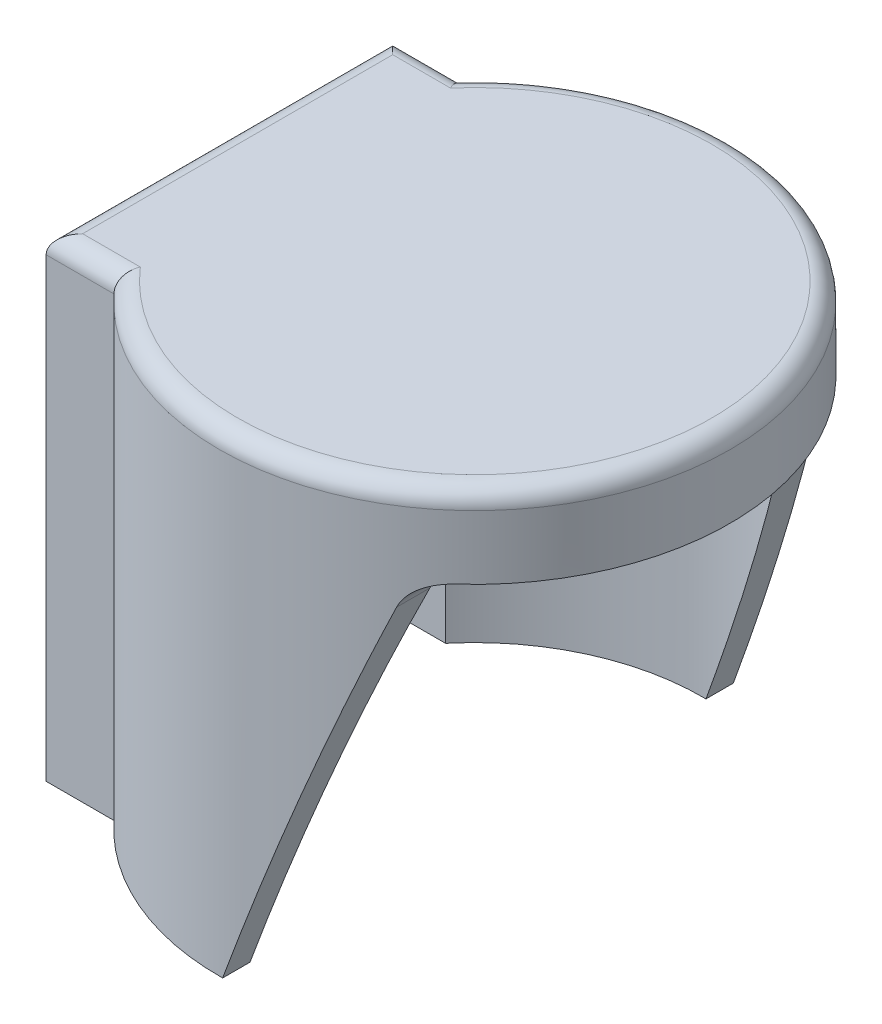
ISO-10303-21;
HEADER;
FILE_DESCRIPTION(('STEP AP214'),'2;1');
FILE_NAME('part.step','',(''),(''),'','','');
FILE_SCHEMA(('AUTOMOTIVE_DESIGN { 1 0 10303 214 1 1 1 1 }'));
ENDSEC;
DATA;
#1=APPLICATION_CONTEXT('core data for automotive mechanical design processes');
#2=APPLICATION_PROTOCOL_DEFINITION('international standard','automotive_design',2000,#1);
#3=PRODUCT_CONTEXT('',#1,'mechanical');
#4=PRODUCT('Part','Part','',(#3));
#5=PRODUCT_RELATED_PRODUCT_CATEGORY('part','',(#4));
#6=PRODUCT_DEFINITION_FORMATION('','',#4);
#7=PRODUCT_DEFINITION_CONTEXT('part definition',#1,'design');
#8=PRODUCT_DEFINITION('design','',#6,#7);
#9=PRODUCT_DEFINITION_SHAPE('','',#8);
#10=(LENGTH_UNIT() NAMED_UNIT(*) SI_UNIT(.MILLI.,.METRE.));
#11=(NAMED_UNIT(*) PLANE_ANGLE_UNIT() SI_UNIT($,.RADIAN.));
#12=(NAMED_UNIT(*) SI_UNIT($,.STERADIAN.) SOLID_ANGLE_UNIT());
#13=UNCERTAINTY_MEASURE_WITH_UNIT(LENGTH_MEASURE(1.E-05),#10,'distance_accuracy_value','');
#14=(GEOMETRIC_REPRESENTATION_CONTEXT(3) GLOBAL_UNCERTAINTY_ASSIGNED_CONTEXT((#13)) GLOBAL_UNIT_ASSIGNED_CONTEXT((#10,
#11,#12)) REPRESENTATION_CONTEXT('',''));
#15=CARTESIAN_POINT('',(0.,0.,0.));
#16=DIRECTION('',(0.,0.,1.));
#17=DIRECTION('',(1.,0.,0.));
#18=AXIS2_PLACEMENT_3D('',#15,#16,#17);
#19=CARTESIAN_POINT('',(0.,0.,0.));
#20=DIRECTION('',(0.,1.,0.));
#21=DIRECTION('',(0.,0.,1.));
#22=AXIS2_PLACEMENT_3D('',#19,#20,#21);
#23=PLANE('',#22);
#24=CARTESIAN_POINT('',(0.,0.,0.));
#25=DIRECTION('',(0.,1.,0.));
#26=DIRECTION('',(0.,0.,1.));
#27=AXIS2_PLACEMENT_3D('',#24,#25,#26);
#28=CIRCLE('',#27,14.);
#29=CARTESIAN_POINT('',(0.174639963276733,0.,-13.9989107034521));
#30=VERTEX_POINT('',#29);
#31=CARTESIAN_POINT('',(-10.2834819006016,0.,-9.5));
#32=VERTEX_POINT('',#31);
#33=EDGE_CURVE('E277',#30,#32,#28,.T.);
#34=ORIENTED_EDGE('',*,*,#33,.F.);
#35=DIRECTION('',(0.,0.,1.));
#36=VECTOR('',#35,1.);
#37=CARTESIAN_POINT('',(0.174639963276733,0.,-14.));
#38=LINE('',#37,#36);
#39=CARTESIAN_POINT('',(0.174639963276733,0.,-12.4987799757907));
#40=VERTEX_POINT('',#39);
#41=EDGE_CURVE('E167',#30,#40,#38,.T.);
#42=ORIENTED_EDGE('',*,*,#41,.T.);
#43=CARTESIAN_POINT('',(0.,0.,0.));
#44=DIRECTION('',(0.,1.,0.));
#45=DIRECTION('',(0.,0.,1.));
#46=AXIS2_PLACEMENT_3D('',#43,#44,#45);
#47=CIRCLE('',#46,12.5);
#48=CARTESIAN_POINT('',(-9.60468635614928,0.,-8.));
#49=VERTEX_POINT('',#48);
#50=EDGE_CURVE('E295',#40,#49,#47,.T.);
#51=ORIENTED_EDGE('',*,*,#50,.T.);
#52=DIRECTION('',(1.,0.,0.));
#53=VECTOR('',#52,1.);
#54=CARTESIAN_POINT('',(0.,0.,-8.));
#55=LINE('',#54,#53);
#56=CARTESIAN_POINT('',(-14.,0.,-8.));
#57=VERTEX_POINT('',#56);
#58=EDGE_CURVE('E363',#57,#49,#55,.T.);
#59=ORIENTED_EDGE('',*,*,#58,.F.);
#60=DIRECTION('',(0.,0.,-1.));
#61=VECTOR('',#60,1.);
#62=CARTESIAN_POINT('',(-14.,0.,9.5));
#63=LINE('',#62,#61);
#64=CARTESIAN_POINT('',(-14.,0.,-9.5));
#65=VERTEX_POINT('',#64);
#66=EDGE_CURVE('E352',#57,#65,#63,.T.);
#67=ORIENTED_EDGE('',*,*,#66,.T.);
#68=DIRECTION('',(1.,0.,0.));
#69=VECTOR('',#68,1.);
#70=CARTESIAN_POINT('',(0.,0.,-9.5));
#71=LINE('',#70,#69);
#72=EDGE_CURVE('E281',#65,#32,#71,.T.);
#73=ORIENTED_EDGE('',*,*,#72,.T.);
#74=EDGE_LOOP('',(#34,#42,#51,#59,#67,#73));
#75=FACE_BOUND('',#74,.T.);
#76=ADVANCED_FACE('F38',(#75),#23,.F.);
#77=CARTESIAN_POINT('',(-14.,0.,9.5));
#78=DIRECTION('',(1.,0.,0.));
#79=DIRECTION('',(0.,0.,-1.));
#80=AXIS2_PLACEMENT_3D('',#77,#78,#79);
#81=PLANE('',#80);
#82=DIRECTION('',(0.,-1.,0.));
#83=VECTOR('',#82,1.);
#84=CARTESIAN_POINT('',(-14.,0.,9.5));
#85=LINE('',#84,#83);
#86=CARTESIAN_POINT('',(-14.,25.,9.5));
#87=VERTEX_POINT('',#86);
#88=CARTESIAN_POINT('',(-14.,0.,9.5));
#89=VERTEX_POINT('',#88);
#90=EDGE_CURVE('E356',#87,#89,#85,.T.);
#91=ORIENTED_EDGE('',*,*,#90,.F.);
#92=DIRECTION('',(0.,0.,-1.));
#93=VECTOR('',#92,1.);
#94=CARTESIAN_POINT('',(-14.,25.,-9.5));
#95=LINE('',#94,#93);
#96=CARTESIAN_POINT('',(-14.,25.,-9.5));
#97=VERTEX_POINT('',#96);
#98=EDGE_CURVE('E53',#87,#97,#95,.T.);
#99=ORIENTED_EDGE('',*,*,#98,.T.);
#100=DIRECTION('',(0.,-1.,0.));
#101=VECTOR('',#100,1.);
#102=CARTESIAN_POINT('',(-14.,0.,-9.5));
#103=LINE('',#102,#101);
#104=EDGE_CURVE('E349',#97,#65,#103,.T.);
#105=ORIENTED_EDGE('',*,*,#104,.T.);
#106=ORIENTED_EDGE('',*,*,#66,.F.);
#107=DIRECTION('',(0.,-1.,0.));
#108=VECTOR('',#107,1.);
#109=CARTESIAN_POINT('',(-14.,0.,-8.));
#110=LINE('',#109,#108);
#111=CARTESIAN_POINT('',(-14.,24.5,-8.));
#112=VERTEX_POINT('',#111);
#113=EDGE_CURVE('E367',#112,#57,#110,.T.);
#114=ORIENTED_EDGE('',*,*,#113,.F.);
#115=DIRECTION('',(0.,0.,-1.));
#116=VECTOR('',#115,1.);
#117=CARTESIAN_POINT('',(-14.,24.5,0.));
#118=LINE('',#117,#116);
#119=CARTESIAN_POINT('',(-14.,24.5,8.));
#120=VERTEX_POINT('',#119);
#121=EDGE_CURVE('E370',#120,#112,#118,.T.);
#122=ORIENTED_EDGE('',*,*,#121,.F.);
#123=DIRECTION('',(0.,-1.,0.));
#124=VECTOR('',#123,1.);
#125=CARTESIAN_POINT('',(-14.,0.,8.));
#126=LINE('',#125,#124);
#127=CARTESIAN_POINT('',(-14.,0.,8.));
#128=VERTEX_POINT('',#127);
#129=EDGE_CURVE('E374',#120,#128,#126,.T.);
#130=ORIENTED_EDGE('',*,*,#129,.T.);
#131=EDGE_CURVE('E350',#89,#128,#63,.T.);
#132=ORIENTED_EDGE('',*,*,#131,.F.);
#133=EDGE_LOOP('',(#91,#99,#105,#106,#114,#122,#130,#132));
#134=FACE_BOUND('',#133,.T.);
#135=ADVANCED_FACE('F257',(#134),#81,.F.);
#136=CARTESIAN_POINT('',(0.,26.,0.));
#137=DIRECTION('',(0.,-1.,0.));
#138=DIRECTION('',(0.,0.,-1.));
#139=AXIS2_PLACEMENT_3D('',#136,#137,#138);
#140=CYLINDRICAL_SURFACE('',#139,14.);
#141=DIRECTION('',(0.,-1.,0.));
#142=VECTOR('',#141,1.);
#143=CARTESIAN_POINT('',(-10.2834819006016,26.,-9.5));
#144=LINE('',#143,#142);
#145=CARTESIAN_POINT('',(-10.2834819006016,25.,-9.5));
#146=VERTEX_POINT('',#145);
#147=EDGE_CURVE('E286',#146,#32,#144,.T.);
#148=ORIENTED_EDGE('',*,*,#147,.F.);
#149=CARTESIAN_POINT('',(0.,25.,0.));
#150=DIRECTION('',(0.,1.,0.));
#151=DIRECTION('',(0.,0.,1.));
#152=AXIS2_PLACEMENT_3D('',#149,#150,#151);
#153=CIRCLE('',#152,14.);
#154=CARTESIAN_POINT('',(-10.2834819006016,25.,9.5));
#155=VERTEX_POINT('',#154);
#156=EDGE_CURVE('E11',#146,#155,#153,.F.);
#157=ORIENTED_EDGE('',*,*,#156,.T.);
#158=DIRECTION('',(0.,-1.,0.));
#159=VECTOR('',#158,1.);
#160=CARTESIAN_POINT('',(-10.2834819006016,26.,9.5));
#161=LINE('',#160,#159);
#162=CARTESIAN_POINT('',(-10.2834819006016,0.,9.5));
#163=VERTEX_POINT('',#162);
#164=EDGE_CURVE('E283',#155,#163,#161,.T.);
#165=ORIENTED_EDGE('',*,*,#164,.T.);
#166=CARTESIAN_POINT('',(0.174639963276733,0.,13.9989107034521));
#167=VERTEX_POINT('',#166);
#168=EDGE_CURVE('E282',#163,#167,#28,.T.);
#169=ORIENTED_EDGE('',*,*,#168,.T.);
#170=CARTESIAN_POINT('',(0.,-0.479819355637217,0.));
#171=DIRECTION('',(-0.93969262078591,0.342020143325666,0.));
#172=DIRECTION('',(-0.342020143325666,-0.93969262078591,0.));
#173=AXIS2_PLACEMENT_3D('',#170,#171,#172);
#174=ELLIPSE('',#173,40.9332616022836,14.);
#175=CARTESIAN_POINT('',(7.5210298348476,20.1840402866513,11.8082221449011));
#176=VERTEX_POINT('',#175);
#177=EDGE_CURVE('E384',#167,#176,#174,.T.);
#178=ORIENTED_EDGE('',*,*,#177,.T.);
#179=CARTESIAN_POINT('',(7.5210298348476,20.1840402866513,11.8082221449011));
#180=CARTESIAN_POINT('',(7.53964416121802,20.2352094824282,11.7963650266052));
#181=CARTESIAN_POINT('',(7.56025929357339,20.2853225516099,11.783173844617));
#182=CARTESIAN_POINT('',(7.60513088326993,20.3830827344216,11.7542631608349));
#183=CARTESIAN_POINT('',(7.62938448034597,20.430731745876,11.7385456443525));
#184=CARTESIAN_POINT('',(7.68104306748721,20.5230056304358,11.7048075369995));
#185=CARTESIAN_POINT('',(7.70842769372308,20.5676473460067,11.6868017518608));
#186=CARTESIAN_POINT('',(7.7660983294997,20.6539963784516,11.6485586344659));
#187=CARTESIAN_POINT('',(7.79638482730228,20.6957031994526,11.628320926585));
#188=CARTESIAN_POINT('',(7.89085962581988,20.8158972188824,11.564603905907));
#189=CARTESIAN_POINT('',(7.95886178942897,20.8898057763714,11.5179924339798));
#190=CARTESIAN_POINT('',(8.10216633661688,21.0245526320818,11.4176430613572));
#191=CARTESIAN_POINT('',(8.17747786945125,21.085374234826,11.3638961974131));
#192=CARTESIAN_POINT('',(8.34193129950177,21.2002367003342,11.2438290393299));
#193=CARTESIAN_POINT('',(8.43166197064205,21.2526603391434,11.1767734025499));
#194=CARTESIAN_POINT('',(8.61427254335412,21.3418272944479,11.0366485917379));
#195=CARTESIAN_POINT('',(8.70715675517663,21.3785481337333,10.9635709749076));
#196=CARTESIAN_POINT('',(8.90103567157139,21.4395241471304,10.8068593214908));
#197=CARTESIAN_POINT('',(9.00209566350913,21.4625772757445,10.7228467897591));
#198=CARTESIAN_POINT('',(9.20273060309242,21.4927709832532,10.5511819273745));
#199=CARTESIAN_POINT('',(9.30231022122739,21.4999836464836,10.4635479418198));
#200=CARTESIAN_POINT('',(9.40041507641943,21.5,10.3745937940252));
#201=B_SPLINE_CURVE_WITH_KNOTS('',3,(#179,#180,#181,#182,#183,#184,#185,#186,#187,#188,#189,
#190,#191,#192,#193,#194,#195,#196,#197,#198,#199,#200),.UNSPECIFIED.,.F.,.F.,(4,2,2,2,2,2,2,2,
2,2,4),(0.,0.167090234565998,0.334049798094063,0.499979394002213,0.665936958012112,
0.996605964460247,1.32769434791578,1.69738267648325,2.06759842507823,2.46681939068946,
2.86421984598594),.UNSPECIFIED.);
#202=CARTESIAN_POINT('',(9.40041507641944,21.5,10.3745937940252));
#203=VERTEX_POINT('',#202);
#204=EDGE_CURVE('E163',#176,#203,#201,.T.);
#205=ORIENTED_EDGE('',*,*,#204,.T.);
#206=CARTESIAN_POINT('',(0.,21.5,0.));
#207=DIRECTION('',(0.,1.,0.));
#208=DIRECTION('',(0.,0.,1.));
#209=AXIS2_PLACEMENT_3D('',#206,#207,#208);
#210=CIRCLE('',#209,14.);
#211=CARTESIAN_POINT('',(9.40041507641944,21.5,-10.3745937940252));
#212=VERTEX_POINT('',#211);
#213=EDGE_CURVE('E157',#203,#212,#210,.T.);
#214=ORIENTED_EDGE('',*,*,#213,.T.);
#215=CARTESIAN_POINT('',(9.40041507641944,21.5,-10.3745937940252));
#216=CARTESIAN_POINT('',(9.33795212595386,21.4999945214225,-10.4311998485813));
#217=CARTESIAN_POINT('',(9.27495096262056,21.4970724438754,-10.4872495153663));
#218=CARTESIAN_POINT('',(9.14820219496933,21.4850576544909,-10.5979924235593));
#219=CARTESIAN_POINT('',(9.08445369550329,21.4759565933134,-10.6526837256943));
#220=CARTESIAN_POINT('',(8.95622221058412,21.4511499382536,-10.7607236013025));
#221=CARTESIAN_POINT('',(8.89173734010608,21.4353942701503,-10.8140586745226));
#222=CARTESIAN_POINT('',(8.76313337993291,21.3969388282564,-10.9185329760418));
#223=CARTESIAN_POINT('',(8.69901410254167,21.3742430213509,-10.9696734397557));
#224=CARTESIAN_POINT('',(8.53432969973797,21.3060583961757,-11.0987217670025));
#225=CARTESIAN_POINT('',(8.43447336093399,21.2550112438014,-11.1747129779921));
#226=CARTESIAN_POINT('',(8.24094338114474,21.1335899521312,-11.3181853811845));
#227=CARTESIAN_POINT('',(8.14725242599497,21.0632730759382,-11.3856909362228));
#228=CARTESIAN_POINT('',(7.9840136391063,20.9156145437415,-11.5006046992267));
#229=CARTESIAN_POINT('',(7.91298009415029,20.8410831155087,-11.5495051731489));
#230=CARTESIAN_POINT('',(7.7813660934855,20.6787894039009,-11.6385843936173));
#231=CARTESIAN_POINT('',(7.72076853117131,20.5910492234563,-11.6787774417764));
#232=CARTESIAN_POINT('',(7.63860351371989,20.4482980233732,-11.7325572204531));
#233=CARTESIAN_POINT('',(7.61211864450436,20.397398703656,-11.7497448772734));
#234=CARTESIAN_POINT('',(7.56333400259621,20.2927604434087,-11.7812057399427));
#235=CARTESIAN_POINT('',(7.54103518459539,20.2390208586861,-11.7954782810209));
#236=CARTESIAN_POINT('',(7.52102983484761,20.1840402866513,-11.8082221449011));
#237=B_SPLINE_CURVE_WITH_KNOTS('',3,(#215,#216,#217,#218,#219,#220,#221,#222,#223,#224,#225,
#226,#227,#228,#229,#230,#231,#232,#233,#234,#235,#236),.UNSPECIFIED.,.F.,.F.,(4,2,2,2,2,2,2,2,
2,2,4),(0.,0.252871692749005,0.506085759745772,0.761240132326026,1.01624893402829,
1.42100688096779,1.82457482860889,2.1651425670201,2.50514662231578,2.68458223283801,
2.86405871675947),.UNSPECIFIED.);
#238=CARTESIAN_POINT('',(7.5210298348476,20.1840402866513,-11.8082221449011));
#239=VERTEX_POINT('',#238);
#240=EDGE_CURVE('E161',#212,#239,#237,.T.);
#241=ORIENTED_EDGE('',*,*,#240,.T.);
#242=EDGE_CURVE('E291',#239,#30,#174,.T.);
#243=ORIENTED_EDGE('',*,*,#242,.T.);
#244=ORIENTED_EDGE('',*,*,#33,.T.);
#245=EDGE_LOOP('',(#148,#157,#165,#169,#178,#205,#214,#241,#243,#244));
#246=FACE_BOUND('',#245,.T.);
#247=ADVANCED_FACE('F159',(#246),#140,.T.);
#248=CARTESIAN_POINT('',(0.,26.,0.));
#249=DIRECTION('',(0.,1.,0.));
#250=DIRECTION('',(0.,0.,1.));
#251=AXIS2_PLACEMENT_3D('',#248,#249,#250);
#252=PLANE('',#251);
#253=DIRECTION('',(-1.,0.,0.));
#254=VECTOR('',#253,1.);
#255=CARTESIAN_POINT('',(-14.,26.,-8.5));
#256=LINE('',#255,#254);
#257=CARTESIAN_POINT('',(-9.83615778645304,26.,-8.49999999999996));
#258=VERTEX_POINT('',#257);
#259=CARTESIAN_POINT('',(-13.,26.,-8.5));
#260=VERTEX_POINT('',#259);
#261=EDGE_CURVE('E304',#258,#260,#256,.T.);
#262=ORIENTED_EDGE('',*,*,#261,.T.);
#263=DIRECTION('',(0.,0.,-1.));
#264=VECTOR('',#263,1.);
#265=CARTESIAN_POINT('',(-13.,26.,9.5));
#266=LINE('',#265,#264);
#267=CARTESIAN_POINT('',(-13.,26.,8.5));
#268=VERTEX_POINT('',#267);
#269=EDGE_CURVE('E308',#260,#268,#266,.F.);
#270=ORIENTED_EDGE('',*,*,#269,.T.);
#271=DIRECTION('',(-1.,0.,0.));
#272=VECTOR('',#271,1.);
#273=CARTESIAN_POINT('',(0.,26.,8.5));
#274=LINE('',#273,#272);
#275=CARTESIAN_POINT('',(-9.83615778645304,26.,8.49999999999996));
#276=VERTEX_POINT('',#275);
#277=EDGE_CURVE('E300',#268,#276,#274,.F.);
#278=ORIENTED_EDGE('',*,*,#277,.T.);
#279=CARTESIAN_POINT('',(0.,26.,0.));
#280=DIRECTION('',(0.,1.,0.));
#281=DIRECTION('',(0.,0.,1.));
#282=AXIS2_PLACEMENT_3D('',#279,#280,#281);
#283=CIRCLE('',#282,13.);
#284=EDGE_CURVE('E297',#276,#258,#283,.T.);
#285=ORIENTED_EDGE('',*,*,#284,.T.);
#286=EDGE_LOOP('',(#262,#270,#278,#285));
#287=FACE_BOUND('',#286,.T.);
#288=ADVANCED_FACE('F261',(#287),#252,.T.);
#289=CARTESIAN_POINT('',(-9.60468635614928,0.,8.));
#290=VERTEX_POINT('',#289);
#291=CARTESIAN_POINT('',(0.174639963276733,0.,12.4987799757907));
#292=VERTEX_POINT('',#291);
#293=EDGE_CURVE('E379',#290,#292,#47,.T.);
#294=ORIENTED_EDGE('',*,*,#293,.T.);
#295=EDGE_CURVE('E292',#292,#167,#38,.T.);
#296=ORIENTED_EDGE('',*,*,#295,.T.);
#297=ORIENTED_EDGE('',*,*,#168,.F.);
#298=DIRECTION('',(1.,0.,0.));
#299=VECTOR('',#298,1.);
#300=CARTESIAN_POINT('',(0.,0.,9.5));
#301=LINE('',#300,#299);
#302=EDGE_CURVE('E359',#89,#163,#301,.T.);
#303=ORIENTED_EDGE('',*,*,#302,.F.);
#304=ORIENTED_EDGE('',*,*,#131,.T.);
#305=DIRECTION('',(1.,0.,0.));
#306=VECTOR('',#305,1.);
#307=CARTESIAN_POINT('',(0.,0.,8.));
#308=LINE('',#307,#306);
#309=EDGE_CURVE('E373',#128,#290,#308,.T.);
#310=ORIENTED_EDGE('',*,*,#309,.T.);
#311=EDGE_LOOP('',(#294,#296,#297,#303,#304,#310));
#312=FACE_BOUND('',#311,.T.);
#313=ADVANCED_FACE('F253',(#312),#23,.F.);
#314=CARTESIAN_POINT('',(0.,0.,9.5));
#315=DIRECTION('',(0.,0.,1.));
#316=DIRECTION('',(1.,0.,0.));
#317=AXIS2_PLACEMENT_3D('',#314,#315,#316);
#318=PLANE('',#317);
#319=ORIENTED_EDGE('',*,*,#164,.F.);
#320=DIRECTION('',(-1.,0.,0.));
#321=VECTOR('',#320,1.);
#322=CARTESIAN_POINT('',(0.,25.,9.5));
#323=LINE('',#322,#321);
#324=EDGE_CURVE('E61',#155,#87,#323,.T.);
#325=ORIENTED_EDGE('',*,*,#324,.T.);
#326=ORIENTED_EDGE('',*,*,#90,.T.);
#327=ORIENTED_EDGE('',*,*,#302,.T.);
#328=EDGE_LOOP('',(#319,#325,#326,#327));
#329=FACE_BOUND('',#328,.T.);
#330=ADVANCED_FACE('F250',(#329),#318,.T.);
#331=CARTESIAN_POINT('',(0.,0.,-9.5));
#332=DIRECTION('',(0.,0.,1.));
#333=DIRECTION('',(1.,0.,0.));
#334=AXIS2_PLACEMENT_3D('',#331,#332,#333);
#335=PLANE('',#334);
#336=ORIENTED_EDGE('',*,*,#104,.F.);
#337=DIRECTION('',(-1.,0.,0.));
#338=VECTOR('',#337,1.);
#339=CARTESIAN_POINT('',(-10.2834819006016,25.,-9.5));
#340=LINE('',#339,#338);
#341=EDGE_CURVE('E310',#97,#146,#340,.F.);
#342=ORIENTED_EDGE('',*,*,#341,.T.);
#343=ORIENTED_EDGE('',*,*,#147,.T.);
#344=ORIENTED_EDGE('',*,*,#72,.F.);
#345=EDGE_LOOP('',(#336,#342,#343,#344));
#346=FACE_BOUND('',#345,.T.);
#347=ADVANCED_FACE('F236',(#346),#335,.F.);
#348=CARTESIAN_POINT('',(0.,26.,0.));
#349=DIRECTION('',(0.,-1.,0.));
#350=DIRECTION('',(0.,0.,-1.));
#351=AXIS2_PLACEMENT_3D('',#348,#349,#350);
#352=CYLINDRICAL_SURFACE('',#351,12.5);
#353=CARTESIAN_POINT('',(0.,-0.479819355637217,0.));
#354=DIRECTION('',(-0.93969262078591,0.342020143325666,0.));
#355=DIRECTION('',(-0.342020143325666,-0.93969262078591,0.));
#356=AXIS2_PLACEMENT_3D('',#353,#354,#355);
#357=ELLIPSE('',#356,36.5475550020389,12.5);
#358=CARTESIAN_POINT('',(7.5210298348476,20.1840402866513,9.98419301813283));
#359=VERTEX_POINT('',#358);
#360=EDGE_CURVE('E296',#292,#359,#357,.T.);
#361=ORIENTED_EDGE('',*,*,#360,.F.);
#362=ORIENTED_EDGE('',*,*,#293,.F.);
#363=DIRECTION('',(0.,-1.,0.));
#364=VECTOR('',#363,1.);
#365=CARTESIAN_POINT('',(-9.60468635614928,24.5,8.));
#366=LINE('',#365,#364);
#367=CARTESIAN_POINT('',(-9.60468635614928,24.5,8.));
#368=VERTEX_POINT('',#367);
#369=EDGE_CURVE('E386',#368,#290,#366,.T.);
#370=ORIENTED_EDGE('',*,*,#369,.F.);
#371=CARTESIAN_POINT('',(0.,24.5,0.));
#372=DIRECTION('',(0.,1.,0.));
#373=DIRECTION('',(0.,0.,1.));
#374=AXIS2_PLACEMENT_3D('',#371,#372,#373);
#375=CIRCLE('',#374,12.5);
#376=CARTESIAN_POINT('',(-9.60468635614928,24.5,-8.));
#377=VERTEX_POINT('',#376);
#378=EDGE_CURVE('E358',#368,#377,#375,.T.);
#379=ORIENTED_EDGE('',*,*,#378,.T.);
#380=DIRECTION('',(0.,-1.,0.));
#381=VECTOR('',#380,1.);
#382=CARTESIAN_POINT('',(-9.60468635614928,24.5,-8.));
#383=LINE('',#382,#381);
#384=EDGE_CURVE('E372',#377,#49,#383,.T.);
#385=ORIENTED_EDGE('',*,*,#384,.T.);
#386=ORIENTED_EDGE('',*,*,#50,.F.);
#387=CARTESIAN_POINT('',(7.5210298348476,20.1840402866513,-9.98419301813283));
#388=VERTEX_POINT('',#387);
#389=EDGE_CURVE('E229',#388,#40,#357,.T.);
#390=ORIENTED_EDGE('',*,*,#389,.F.);
#391=CARTESIAN_POINT('',(9.40041507641944,21.5,-8.23906526197154));
#392=CARTESIAN_POINT('',(9.33134105498748,21.499984116413,-8.31789425667587));
#393=CARTESIAN_POINT('',(9.26121912405547,21.4964182611215,-8.39588216924079));
#394=CARTESIAN_POINT('',(9.1192451697094,21.4814319987808,-8.54987045488769));
#395=CARTESIAN_POINT('',(9.04738899786413,21.4699904778331,-8.62586491379376));
#396=CARTESIAN_POINT('',(8.90190250787866,21.4383189292312,-8.77594349709575));
#397=CARTESIAN_POINT('',(8.82826139173239,21.4179945872011,-8.8499978204644));
#398=CARTESIAN_POINT('',(8.68093689278034,21.3677268928209,-8.99455248050032));
#399=CARTESIAN_POINT('',(8.60725366916202,21.3377952191737,-9.06505701253942));
#400=CARTESIAN_POINT('',(8.44082839814861,21.257808708376,-9.22055558115811));
#401=CARTESIAN_POINT('',(8.34838508532501,21.2044892039932,-9.30423899400981));
#402=CARTESIAN_POINT('',(8.16866906280989,21.0794668707845,-9.4624048874885));
#403=CARTESIAN_POINT('',(8.08137861656984,21.0078322500895,-9.53692001901233));
#404=CARTESIAN_POINT('',(7.92999519674874,20.8591017850868,-9.66298158777884));
#405=CARTESIAN_POINT('',(7.86447164944451,20.7849592072767,-9.71628265690848));
#406=CARTESIAN_POINT('',(7.7429500983497,20.6238045722391,-9.81339697219528));
#407=CARTESIAN_POINT('',(7.68693373651391,20.5368179384009,-9.85722854935347));
#408=CARTESIAN_POINT('',(7.61523686090706,20.4029619519664,-9.91256555756768));
#409=CARTESIAN_POINT('',(7.59441205258384,20.3605896659058,-9.92852000060317));
#410=CARTESIAN_POINT('',(7.55555945226821,20.2738004758671,-9.95811781205938));
#411=CARTESIAN_POINT('',(7.53753197995155,20.2293833389571,-9.97176091635978));
#412=CARTESIAN_POINT('',(7.5210298348476,20.1840402866513,-9.98419301813283));
#413=B_SPLINE_CURVE_WITH_KNOTS('',3,(#391,#392,#393,#394,#395,#396,#397,#398,#399,#400,#401,
#402,#403,#404,#405,#406,#407,#408,#409,#410,#411,#412),.UNSPECIFIED.,.F.,.F.,(4,2,2,2,2,2,2,2,
2,2,4),(0.,0.314449411809667,0.629745132276263,0.948473109132464,1.26681509732919,
1.67221840408546,2.07613338028545,2.41199984165814,2.74721018991175,2.89656843045971,
3.04594372691391),.UNSPECIFIED.);
#414=CARTESIAN_POINT('',(9.40041507641944,21.5,-8.23906526197154));
#415=VERTEX_POINT('',#414);
#416=EDGE_CURVE('E214',#415,#388,#413,.T.);
#417=ORIENTED_EDGE('',*,*,#416,.F.);
#418=CARTESIAN_POINT('',(0.,21.5,0.));
#419=DIRECTION('',(0.,1.,0.));
#420=DIRECTION('',(0.,0.,1.));
#421=AXIS2_PLACEMENT_3D('',#418,#419,#420);
#422=CIRCLE('',#421,12.5);
#423=CARTESIAN_POINT('',(9.40041507641944,21.5,8.23906526197154));
#424=VERTEX_POINT('',#423);
#425=EDGE_CURVE('E180',#424,#415,#422,.T.);
#426=ORIENTED_EDGE('',*,*,#425,.F.);
#427=CARTESIAN_POINT('',(7.5210298348476,20.1840402866513,9.98419301813283));
#428=CARTESIAN_POINT('',(7.53948517440466,20.2347735663476,9.97028985678865));
#429=CARTESIAN_POINT('',(7.55986863560799,20.2843599089869,9.95485588682352));
#430=CARTESIAN_POINT('',(7.60407704292878,20.3808942295186,9.92112840228522));
#431=CARTESIAN_POINT('',(7.62789837722727,20.4278449054112,9.90283788715306));
#432=CARTESIAN_POINT('',(7.6784099509673,20.518515118071,9.86372290322524));
#433=CARTESIAN_POINT('',(7.70507633929395,20.5622570200279,9.84291933326059));
#434=CARTESIAN_POINT('',(7.76102769080538,20.6467250278231,9.79886332856466));
#435=CARTESIAN_POINT('',(7.79031328513185,20.687450402433,9.77561030335468));
#436=CARTESIAN_POINT('',(7.88125798227418,20.8045639419319,9.70266757771394));
#437=CARTESIAN_POINT('',(7.94625617219056,20.8763295018763,9.64960188694123));
#438=CARTESIAN_POINT('',(8.08229097506071,21.00714879296,9.53595717510099));
#439=CARTESIAN_POINT('',(8.1533394445416,21.0661767241207,9.47536328950627));
#440=CARTESIAN_POINT('',(8.33356510884439,21.1968830519338,9.31782681688415));
#441=CARTESIAN_POINT('',(8.44485883187699,21.2613050934843,9.21726431945279));
#442=CARTESIAN_POINT('',(8.66964603963286,21.3658573506708,9.00617453834188));
#443=CARTESIAN_POINT('',(8.7831450864486,21.40591468268,8.8956184822808));
#444=CARTESIAN_POINT('',(8.98187749599574,21.457742531765,8.69430423177076));
#445=CARTESIAN_POINT('',(9.06748909824702,21.4739468532104,8.60499413835789));
#446=CARTESIAN_POINT('',(9.23601977746981,21.4950168118687,8.42385084832009));
#447=CARTESIAN_POINT('',(9.3189546029712,21.4999695416689,8.33204263729203));
#448=CARTESIAN_POINT('',(9.40041507641943,21.5,8.23906526197154));
#449=B_SPLINE_CURVE_WITH_KNOTS('',3,(#427,#428,#429,#430,#431,#432,#433,#434,#435,#436,#437,
#438,#439,#440,#441,#442,#443,#444,#445,#446,#447,#448),.UNSPECIFIED.,.F.,.F.,(4,2,2,2,2,2,2,2,
2,2,4),(0.,0.167141576939942,0.334108816768244,0.499772456803048,0.665476124386676,
0.995277356424253,1.32574045546474,1.8127706760521,2.3012507050539,2.67501177157983,
3.0458697491439),.UNSPECIFIED.);
#450=EDGE_CURVE('E222',#359,#424,#449,.T.);
#451=ORIENTED_EDGE('',*,*,#450,.F.);
#452=EDGE_LOOP('',(#361,#362,#370,#379,#385,#386,#390,#417,#426,#451));
#453=FACE_BOUND('',#452,.T.);
#454=ADVANCED_FACE('F231',(#453),#352,.F.);
#455=CARTESIAN_POINT('',(0.,24.5,0.));
#456=DIRECTION('',(0.,1.,0.));
#457=DIRECTION('',(0.,0.,1.));
#458=AXIS2_PLACEMENT_3D('',#455,#456,#457);
#459=PLANE('',#458);
#460=DIRECTION('',(-1.,0.,0.));
#461=VECTOR('',#460,1.);
#462=CARTESIAN_POINT('',(0.,24.5,-8.));
#463=LINE('',#462,#461);
#464=EDGE_CURVE('E369',#377,#112,#463,.T.);
#465=ORIENTED_EDGE('',*,*,#464,.F.);
#466=ORIENTED_EDGE('',*,*,#378,.F.);
#467=DIRECTION('',(-1.,0.,0.));
#468=VECTOR('',#467,1.);
#469=CARTESIAN_POINT('',(0.,24.5,8.));
#470=LINE('',#469,#468);
#471=EDGE_CURVE('E366',#368,#120,#470,.T.);
#472=ORIENTED_EDGE('',*,*,#471,.T.);
#473=ORIENTED_EDGE('',*,*,#121,.T.);
#474=EDGE_LOOP('',(#465,#466,#472,#473));
#475=FACE_BOUND('',#474,.T.);
#476=ADVANCED_FACE('F235',(#475),#459,.F.);
#477=CARTESIAN_POINT('',(0.,0.,8.));
#478=DIRECTION('',(0.,0.,1.));
#479=DIRECTION('',(1.,0.,0.));
#480=AXIS2_PLACEMENT_3D('',#477,#478,#479);
#481=PLANE('',#480);
#482=ORIENTED_EDGE('',*,*,#369,.T.);
#483=ORIENTED_EDGE('',*,*,#309,.F.);
#484=ORIENTED_EDGE('',*,*,#129,.F.);
#485=ORIENTED_EDGE('',*,*,#471,.F.);
#486=EDGE_LOOP('',(#482,#483,#484,#485));
#487=FACE_BOUND('',#486,.T.);
#488=ADVANCED_FACE('F241',(#487),#481,.F.);
#489=CARTESIAN_POINT('',(0.,0.,-8.));
#490=DIRECTION('',(0.,0.,1.));
#491=DIRECTION('',(1.,0.,0.));
#492=AXIS2_PLACEMENT_3D('',#489,#490,#491);
#493=PLANE('',#492);
#494=ORIENTED_EDGE('',*,*,#464,.T.);
#495=ORIENTED_EDGE('',*,*,#113,.T.);
#496=ORIENTED_EDGE('',*,*,#58,.T.);
#497=ORIENTED_EDGE('',*,*,#384,.F.);
#498=EDGE_LOOP('',(#494,#495,#496,#497));
#499=FACE_BOUND('',#498,.T.);
#500=ADVANCED_FACE('F245',(#499),#493,.T.);
#501=CARTESIAN_POINT('',(0.174639963276733,0.,-14.));
#502=DIRECTION('',(-0.93969262078591,0.342020143325666,0.));
#503=DIRECTION('',(-0.342020143325666,-0.93969262078591,0.));
#504=AXIS2_PLACEMENT_3D('',#501,#502,#503);
#505=PLANE('',#504);
#506=ORIENTED_EDGE('',*,*,#295,.F.);
#507=ORIENTED_EDGE('',*,*,#360,.T.);
#508=DIRECTION('',(0.,0.,1.));
#509=VECTOR('',#508,1.);
#510=CARTESIAN_POINT('',(7.5210298348476,20.1840402866513,-14.));
#511=LINE('',#510,#509);
#512=EDGE_CURVE('E181',#359,#176,#511,.T.);
#513=ORIENTED_EDGE('',*,*,#512,.T.);
#514=ORIENTED_EDGE('',*,*,#177,.F.);
#515=EDGE_LOOP('',(#506,#507,#513,#514));
#516=FACE_BOUND('',#515,.T.);
#517=ADVANCED_FACE('F209',(#516),#505,.F.);
#518=EDGE_CURVE('E176',#239,#388,#511,.T.);
#519=ORIENTED_EDGE('',*,*,#518,.T.);
#520=ORIENTED_EDGE('',*,*,#389,.T.);
#521=ORIENTED_EDGE('',*,*,#41,.F.);
#522=ORIENTED_EDGE('',*,*,#242,.F.);
#523=EDGE_LOOP('',(#519,#520,#521,#522));
#524=FACE_BOUND('',#523,.T.);
#525=ADVANCED_FACE('F207',(#524),#505,.F.);
#526=CARTESIAN_POINT('',(9.40041507641943,19.5,-14.));
#527=DIRECTION('',(0.,0.,1.));
#528=DIRECTION('',(1.,0.,0.));
#529=AXIS2_PLACEMENT_3D('',#526,#527,#528);
#530=CYLINDRICAL_SURFACE('',#529,2.);
#531=ORIENTED_EDGE('',*,*,#512,.F.);
#532=ORIENTED_EDGE('',*,*,#450,.T.);
#533=DIRECTION('',(0.,0.,1.));
#534=VECTOR('',#533,1.);
#535=CARTESIAN_POINT('',(9.40041507641944,21.5,-14.));
#536=LINE('',#535,#534);
#537=EDGE_CURVE('E182',#424,#203,#536,.T.);
#538=ORIENTED_EDGE('',*,*,#537,.T.);
#539=ORIENTED_EDGE('',*,*,#204,.F.);
#540=EDGE_LOOP('',(#531,#532,#538,#539));
#541=FACE_BOUND('',#540,.T.);
#542=ADVANCED_FACE('F202',(#541),#530,.F.);
#543=EDGE_CURVE('E173',#212,#415,#536,.T.);
#544=ORIENTED_EDGE('',*,*,#543,.T.);
#545=ORIENTED_EDGE('',*,*,#416,.T.);
#546=ORIENTED_EDGE('',*,*,#518,.F.);
#547=ORIENTED_EDGE('',*,*,#240,.F.);
#548=EDGE_LOOP('',(#544,#545,#546,#547));
#549=FACE_BOUND('',#548,.T.);
#550=ADVANCED_FACE('F172',(#549),#530,.F.);
#551=CARTESIAN_POINT('',(9.40041507641944,21.5,-14.));
#552=DIRECTION('',(0.,1.,0.));
#553=DIRECTION('',(0.,0.,1.));
#554=AXIS2_PLACEMENT_3D('',#551,#552,#553);
#555=PLANE('',#554);
#556=ORIENTED_EDGE('',*,*,#537,.F.);
#557=ORIENTED_EDGE('',*,*,#425,.T.);
#558=ORIENTED_EDGE('',*,*,#543,.F.);
#559=ORIENTED_EDGE('',*,*,#213,.F.);
#560=EDGE_LOOP('',(#556,#557,#558,#559));
#561=FACE_BOUND('',#560,.T.);
#562=ADVANCED_FACE('F178',(#561),#555,.F.);
#563=CARTESIAN_POINT('',(0.,25.,8.5));
#564=DIRECTION('',(-1.,0.,0.));
#565=DIRECTION('',(0.,0.,1.));
#566=AXIS2_PLACEMENT_3D('',#563,#564,#565);
#567=CYLINDRICAL_SURFACE('',#566,1.);
#568=CARTESIAN_POINT('',(-13.,25.,8.5));
#569=DIRECTION('',(0.707106781186547,0.,0.707106781186547));
#570=DIRECTION('',(-0.707106781186547,0.,0.707106781186547));
#571=AXIS2_PLACEMENT_3D('',#568,#569,#570);
#572=ELLIPSE('',#571,1.41421356237309,1.);
#573=EDGE_CURVE('E322',#87,#268,#572,.F.);
#574=ORIENTED_EDGE('',*,*,#573,.F.);
#575=ORIENTED_EDGE('',*,*,#324,.F.);
#576=CARTESIAN_POINT('',(-10.2834819006016,25.,9.5));
#577=CARTESIAN_POINT('',(-10.283482215541,25.0264175952982,9.50000094920324));
#578=CARTESIAN_POINT('',(-10.2830234936004,25.0528218955528,9.49895241689073));
#579=CARTESIAN_POINT('',(-10.2811961351482,25.1054283408039,9.49477696860874));
#580=CARTESIAN_POINT('',(-10.2798276937185,25.1316305279236,9.49165049823604));
#581=CARTESIAN_POINT('',(-10.2743835026095,25.2094906940835,9.47921582083135));
#582=CARTESIAN_POINT('',(-10.268968740629,25.2606048367697,9.46685198760637));
#583=CARTESIAN_POINT('',(-10.2547769822448,25.3598001066668,9.43448903998783));
#584=CARTESIAN_POINT('',(-10.2460010730646,25.4078822087947,9.4144923945717));
#585=CARTESIAN_POINT('',(-10.225399703399,25.4998790689603,9.36763259069195));
#586=CARTESIAN_POINT('',(-10.2135729620084,25.5437920659611,9.34076654812363));
#587=CARTESIAN_POINT('',(-10.1868153024132,25.627852396137,9.28011351759851));
#588=CARTESIAN_POINT('',(-10.1717941526031,25.6678257042311,9.24612590443563));
#589=CARTESIAN_POINT('',(-10.1393611912567,25.741527473688,9.17293139569374));
#590=CARTESIAN_POINT('',(-10.1219486510781,25.7752540243172,9.1337229094574));
#591=CARTESIAN_POINT('',(-10.0837319298392,25.838357679908,9.04791740683499));
#592=CARTESIAN_POINT('',(-10.0627681555148,25.8671756967844,9.0009807922835));
#593=CARTESIAN_POINT('',(-10.0191494081955,25.916538748708,8.90365326528037));
#594=CARTESIAN_POINT('',(-9.99649359004851,25.9370796162317,8.85326062763452));
#595=CARTESIAN_POINT('',(-9.95161022773977,25.9685716792459,8.75378623897206));
#596=CARTESIAN_POINT('',(-9.92945593237521,25.9800738065216,8.70484337445255));
#597=CARTESIAN_POINT('',(-9.8846098389853,25.9956049586247,8.60611231368289));
#598=CARTESIAN_POINT('',(-9.861919221234,25.9996490809772,8.55632603156417));
#599=CARTESIAN_POINT('',(-9.83817420241431,25.9999927299003,8.50440784416129));
#600=CARTESIAN_POINT('',(-9.83716602932671,26.0000000164536,8.50220382739862));
#601=CARTESIAN_POINT('',(-9.836157786453,26.,8.5));
#602=B_SPLINE_CURVE_WITH_KNOTS('',3,(#576,#577,#578,#579,#580,#581,#582,#583,#584,#585,#586,
#587,#588,#589,#590,#591,#592,#593,#594,#595,#596,#597,#598,#599,#600,#601),.UNSPECIFIED.,.F.,
.F.,(4,2,2,2,2,2,2,2,2,2,2,2,4),(0.,0.079201925412234,0.158386872098074,0.316157157707684,
0.473876452723804,0.631662074961268,0.794700396855983,0.957788506215315,1.13384458734409,
1.30998920182902,1.47431584798578,1.63830947471536,1.64558042025684),.UNSPECIFIED.);
#603=EDGE_CURVE('E43',#276,#155,#602,.F.);
#604=ORIENTED_EDGE('',*,*,#603,.F.);
#605=ORIENTED_EDGE('',*,*,#277,.F.);
#606=EDGE_LOOP('',(#574,#575,#604,#605));
#607=FACE_BOUND('',#606,.T.);
#608=ADVANCED_FACE('F40',(#607),#567,.T.);
#609=CARTESIAN_POINT('',(0.,25.,0.));
#610=DIRECTION('',(0.,1.,0.));
#611=DIRECTION('',(0.,0.,1.));
#612=AXIS2_PLACEMENT_3D('',#609,#610,#611);
#613=TOROIDAL_SURFACE('',#612,13.,1.);
#614=ORIENTED_EDGE('',*,*,#603,.T.);
#615=ORIENTED_EDGE('',*,*,#156,.F.);
#616=CARTESIAN_POINT('',(-10.2834819006016,25.,-9.5));
#617=CARTESIAN_POINT('',(-10.283482215541,25.0264175952982,-9.50000094920324));
#618=CARTESIAN_POINT('',(-10.2830234936004,25.0528218955528,-9.49895241689073));
#619=CARTESIAN_POINT('',(-10.2811961351482,25.1054283408039,-9.49477696860874));
#620=CARTESIAN_POINT('',(-10.2798276937185,25.1316305279236,-9.49165049823604));
#621=CARTESIAN_POINT('',(-10.2743835026095,25.2094906940835,-9.47921582083135));
#622=CARTESIAN_POINT('',(-10.268968740629,25.2606048367697,-9.46685198760637));
#623=CARTESIAN_POINT('',(-10.2547769822448,25.3598001066668,-9.43448903998783));
#624=CARTESIAN_POINT('',(-10.2460010730646,25.4078822087947,-9.4144923945717));
#625=CARTESIAN_POINT('',(-10.225399703399,25.4998790689603,-9.36763259069195));
#626=CARTESIAN_POINT('',(-10.2135729620084,25.5437920659611,-9.34076654812363));
#627=CARTESIAN_POINT('',(-10.1868153024132,25.627852396137,-9.28011351759851));
#628=CARTESIAN_POINT('',(-10.1717941526031,25.6678257042311,-9.24612590443563));
#629=CARTESIAN_POINT('',(-10.1393611912567,25.741527473688,-9.17293139569374));
#630=CARTESIAN_POINT('',(-10.1219486510781,25.7752540243172,-9.1337229094574));
#631=CARTESIAN_POINT('',(-10.0837319298392,25.838357679908,-9.04791740683499));
#632=CARTESIAN_POINT('',(-10.0627681555148,25.8671756967844,-9.0009807922835));
#633=CARTESIAN_POINT('',(-10.0191494081955,25.916538748708,-8.90365326528037));
#634=CARTESIAN_POINT('',(-9.99649359004851,25.9370796162317,-8.85326062763452));
#635=CARTESIAN_POINT('',(-9.95161022773977,25.9685716792459,-8.75378623897206));
#636=CARTESIAN_POINT('',(-9.92945593237521,25.9800738065216,-8.70484337445255));
#637=CARTESIAN_POINT('',(-9.8846098389853,25.9956049586247,-8.60611231368289));
#638=CARTESIAN_POINT('',(-9.861919221234,25.9996490809772,-8.55632603156417));
#639=CARTESIAN_POINT('',(-9.83817420241431,25.9999927299003,-8.50440784416129));
#640=CARTESIAN_POINT('',(-9.83716602932671,26.0000000164536,-8.50220382739862));
#641=CARTESIAN_POINT('',(-9.836157786453,26.,-8.5));
#642=B_SPLINE_CURVE_WITH_KNOTS('',3,(#616,#617,#618,#619,#620,#621,#622,#623,#624,#625,#626,
#627,#628,#629,#630,#631,#632,#633,#634,#635,#636,#637,#638,#639,#640,#641),.UNSPECIFIED.,.F.,
.F.,(4,2,2,2,2,2,2,2,2,2,2,2,4),(0.,0.079201925412234,0.158386872098074,0.316157157707684,
0.473876452723804,0.631662074961268,0.794700396855983,0.957788506215315,1.13384458734409,
1.30998920182902,1.47431584798578,1.63830947471536,1.64558042025684),.UNSPECIFIED.);
#643=EDGE_CURVE('E317',#258,#146,#642,.F.);
#644=ORIENTED_EDGE('',*,*,#643,.F.);
#645=ORIENTED_EDGE('',*,*,#284,.F.);
#646=EDGE_LOOP('',(#614,#615,#644,#645));
#647=FACE_BOUND('',#646,.T.);
#648=ADVANCED_FACE('F325',(#647),#613,.T.);
#649=CARTESIAN_POINT('',(-13.,25.,9.5));
#650=DIRECTION('',(0.,0.,1.));
#651=DIRECTION('',(1.,0.,0.));
#652=AXIS2_PLACEMENT_3D('',#649,#650,#651);
#653=CYLINDRICAL_SURFACE('',#652,1.);
#654=ORIENTED_EDGE('',*,*,#573,.T.);
#655=ORIENTED_EDGE('',*,*,#269,.F.);
#656=CARTESIAN_POINT('',(-13.,25.,-8.5));
#657=DIRECTION('',(-0.707106781186547,0.,0.707106781186547));
#658=DIRECTION('',(0.707106781186547,0.,0.707106781186547));
#659=AXIS2_PLACEMENT_3D('',#656,#657,#658);
#660=ELLIPSE('',#659,1.41421356237309,1.);
#661=EDGE_CURVE('E315',#97,#260,#660,.F.);
#662=ORIENTED_EDGE('',*,*,#661,.F.);
#663=ORIENTED_EDGE('',*,*,#98,.F.);
#664=EDGE_LOOP('',(#654,#655,#662,#663));
#665=FACE_BOUND('',#664,.T.);
#666=ADVANCED_FACE('F328',(#665),#653,.T.);
#667=CARTESIAN_POINT('',(0.,25.,-8.5));
#668=DIRECTION('',(1.,0.,0.));
#669=DIRECTION('',(0.,0.,-1.));
#670=AXIS2_PLACEMENT_3D('',#667,#668,#669);
#671=CYLINDRICAL_SURFACE('',#670,1.);
#672=ORIENTED_EDGE('',*,*,#643,.T.);
#673=ORIENTED_EDGE('',*,*,#341,.F.);
#674=ORIENTED_EDGE('',*,*,#661,.T.);
#675=ORIENTED_EDGE('',*,*,#261,.F.);
#676=EDGE_LOOP('',(#672,#673,#674,#675));
#677=FACE_BOUND('',#676,.T.);
#678=ADVANCED_FACE('F323',(#677),#671,.T.);
#679=CLOSED_SHELL('',(#76,#135,#247,#288,#313,#330,#347,#454,#476,#488,#500,#517,#525,#542,#550,
#562,#608,#648,#666,#678));
#680=MANIFOLD_SOLID_BREP('B2',#679);
#681=ADVANCED_BREP_SHAPE_REPRESENTATION('',(#18,#680),#14);
#682=SHAPE_DEFINITION_REPRESENTATION(#9,#681);
ENDSEC;
END-ISO-10303-21;
